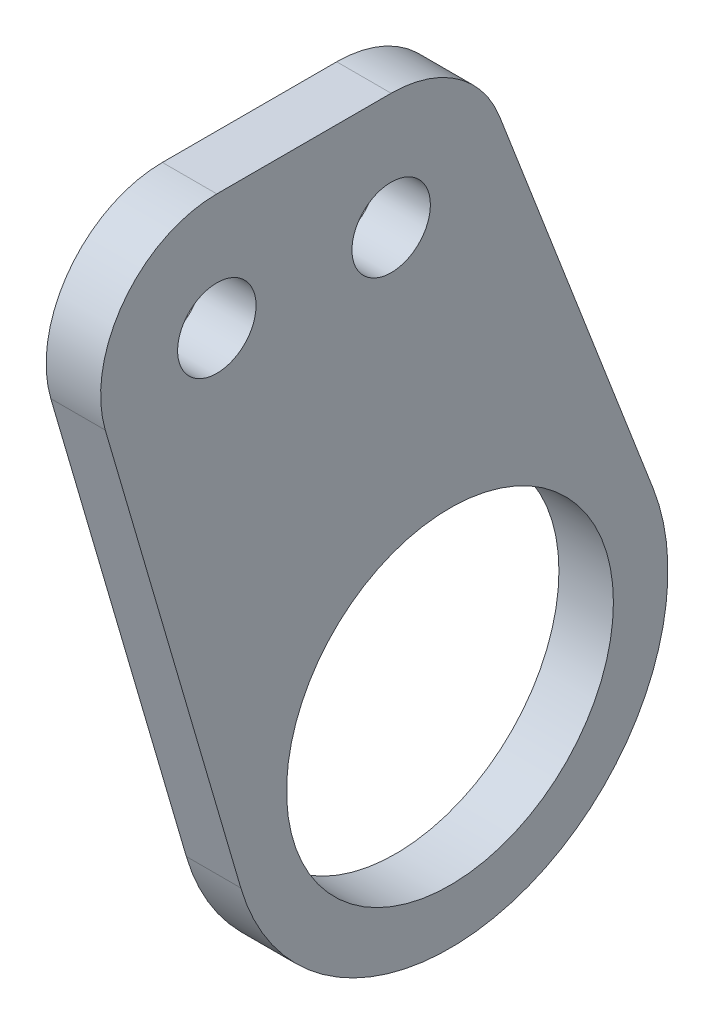
ISO-10303-21;
HEADER;
FILE_DESCRIPTION(('STEP AP214'),'2;1');
FILE_NAME('part.step','',(''),(''),'','','');
FILE_SCHEMA(('AUTOMOTIVE_DESIGN { 1 0 10303 214 1 1 1 1 }'));
ENDSEC;
DATA;
#1=APPLICATION_CONTEXT('core data for automotive mechanical design processes');
#2=APPLICATION_PROTOCOL_DEFINITION('international standard','automotive_design',2000,#1);
#3=PRODUCT_CONTEXT('',#1,'mechanical');
#4=PRODUCT('Part','Part','',(#3));
#5=PRODUCT_RELATED_PRODUCT_CATEGORY('part','',(#4));
#6=PRODUCT_DEFINITION_FORMATION('','',#4);
#7=PRODUCT_DEFINITION_CONTEXT('part definition',#1,'design');
#8=PRODUCT_DEFINITION('design','',#6,#7);
#9=PRODUCT_DEFINITION_SHAPE('','',#8);
#10=(LENGTH_UNIT() NAMED_UNIT(*) SI_UNIT(.MILLI.,.METRE.));
#11=(NAMED_UNIT(*) PLANE_ANGLE_UNIT() SI_UNIT($,.RADIAN.));
#12=(NAMED_UNIT(*) SI_UNIT($,.STERADIAN.) SOLID_ANGLE_UNIT());
#13=UNCERTAINTY_MEASURE_WITH_UNIT(LENGTH_MEASURE(1.E-05),#10,'distance_accuracy_value','');
#14=(GEOMETRIC_REPRESENTATION_CONTEXT(3) GLOBAL_UNCERTAINTY_ASSIGNED_CONTEXT((#13)) GLOBAL_UNIT_ASSIGNED_CONTEXT((#10,
#11,#12)) REPRESENTATION_CONTEXT('',''));
#15=CARTESIAN_POINT('',(0.,0.,0.));
#16=DIRECTION('',(0.,0.,1.));
#17=DIRECTION('',(1.,0.,0.));
#18=AXIS2_PLACEMENT_3D('',#15,#16,#17);
#19=CARTESIAN_POINT('',(4.7625,38.1,20.3835));
#20=DIRECTION('',(1.,0.,0.));
#21=DIRECTION('',(0.,0.,-1.));
#22=AXIS2_PLACEMENT_3D('',#19,#20,#21);
#23=PLANE('',#22);
#24=CARTESIAN_POINT('',(4.7625,38.1,20.3835));
#25=DIRECTION('',(1.,0.,0.));
#26=DIRECTION('',(0.,0.,-1.));
#27=AXIS2_PLACEMENT_3D('',#24,#25,#26);
#28=CIRCLE('',#27,3.429);
#29=CARTESIAN_POINT('',(4.7625,38.1,16.9545));
#30=VERTEX_POINT('',#29);
#31=EDGE_CURVE('E211',#30,#30,#28,.T.);
#32=ORIENTED_EDGE('',*,*,#31,.F.);
#33=EDGE_LOOP('',(#32));
#34=FACE_BOUND('',#33,.T.);
#35=CARTESIAN_POINT('',(4.7625,38.1,20.3835));
#36=DIRECTION('',(1.,0.,0.));
#37=DIRECTION('',(0.,0.,-1.));
#38=AXIS2_PLACEMENT_3D('',#35,#36,#37);
#39=CIRCLE('',#38,10.16);
#40=CARTESIAN_POINT('',(4.7625,48.26,20.3835));
#41=VERTEX_POINT('',#40);
#42=CARTESIAN_POINT('',(4.7625,35.2528565119008,30.1364161771326));
#43=VERTEX_POINT('',#42);
#44=EDGE_CURVE('E150',#41,#43,#39,.T.);
#45=ORIENTED_EDGE('',*,*,#44,.T.);
#46=DIRECTION('',(0.,-0.959932694599662,-0.280230658277485));
#47=VECTOR('',#46,1.);
#48=CARTESIAN_POINT('',(4.7625,35.2528565119008,30.1364161771326));
#49=LINE('',#48,#47);
#50=CARTESIAN_POINT('',(4.7625,-5.33839404018609,18.2867178321236));
#51=VERTEX_POINT('',#50);
#52=EDGE_CURVE('E98',#43,#51,#49,.T.);
#53=ORIENTED_EDGE('',*,*,#52,.T.);
#54=CARTESIAN_POINT('',(4.7625,0.,0.));
#55=DIRECTION('',(1.,0.,0.));
#56=DIRECTION('',(0.,0.,-1.));
#57=AXIS2_PLACEMENT_3D('',#54,#55,#56);
#58=CIRCLE('',#57,19.05);
#59=CARTESIAN_POINT('',(4.7625,6.84499672380729,-17.7777535096836));
#60=VERTEX_POINT('',#59);
#61=EDGE_CURVE('E111',#51,#60,#58,.T.);
#62=ORIENTED_EDGE('',*,*,#61,.T.);
#63=DIRECTION('',(0.,0.933215407332472,0.359317413323217));
#64=VECTOR('',#63,1.);
#65=CARTESIAN_POINT('',(4.7625,41.7506649193639,-4.33796853849792));
#66=LINE('',#65,#64);
#67=CARTESIAN_POINT('',(4.7625,41.7506649193639,-4.33796853849792));
#68=VERTEX_POINT('',#67);
#69=EDGE_CURVE('E105',#60,#68,#66,.T.);
#70=ORIENTED_EDGE('',*,*,#69,.T.);
#71=CARTESIAN_POINT('',(4.7625,38.1,5.1435));
#72=DIRECTION('',(1.,0.,0.));
#73=DIRECTION('',(0.,0.,-1.));
#74=AXIS2_PLACEMENT_3D('',#71,#72,#73);
#75=CIRCLE('',#74,10.16);
#76=CARTESIAN_POINT('',(4.7625,48.26,5.1435));
#77=VERTEX_POINT('',#76);
#78=EDGE_CURVE('E109',#68,#77,#75,.T.);
#79=ORIENTED_EDGE('',*,*,#78,.T.);
#80=DIRECTION('',(0.,0.,1.));
#81=VECTOR('',#80,1.);
#82=CARTESIAN_POINT('',(4.7625,48.26,20.3835));
#83=LINE('',#82,#81);
#84=EDGE_CURVE('E61',#77,#41,#83,.T.);
#85=ORIENTED_EDGE('',*,*,#84,.T.);
#86=EDGE_LOOP('',(#45,#53,#62,#70,#79,#85));
#87=FACE_BOUND('',#86,.T.);
#88=CARTESIAN_POINT('',(4.7625,0.,0.));
#89=DIRECTION('',(1.,0.,0.));
#90=DIRECTION('',(0.,0.,-1.));
#91=AXIS2_PLACEMENT_3D('',#88,#89,#90);
#92=CIRCLE('',#91,14.2875);
#93=CARTESIAN_POINT('',(4.7625,0.,-14.2875));
#94=VERTEX_POINT('',#93);
#95=EDGE_CURVE('E138',#94,#94,#92,.T.);
#96=ORIENTED_EDGE('',*,*,#95,.F.);
#97=EDGE_LOOP('',(#96));
#98=FACE_BOUND('',#97,.T.);
#99=CARTESIAN_POINT('',(4.7625,38.1,5.1435));
#100=DIRECTION('',(1.,0.,0.));
#101=DIRECTION('',(0.,0.,-1.));
#102=AXIS2_PLACEMENT_3D('',#99,#100,#101);
#103=CIRCLE('',#102,3.429);
#104=CARTESIAN_POINT('',(4.7625,38.1,1.7145));
#105=VERTEX_POINT('',#104);
#106=EDGE_CURVE('E200',#105,#105,#103,.T.);
#107=ORIENTED_EDGE('',*,*,#106,.F.);
#108=EDGE_LOOP('',(#107));
#109=FACE_BOUND('',#108,.T.);
#110=ADVANCED_FACE('F43',(#34,#87,#98,#109),#23,.T.);
#111=CARTESIAN_POINT('',(0.,38.1,20.3835));
#112=DIRECTION('',(1.,0.,0.));
#113=DIRECTION('',(0.,0.,-1.));
#114=AXIS2_PLACEMENT_3D('',#111,#112,#113);
#115=PLANE('',#114);
#116=CARTESIAN_POINT('',(0.,38.1,20.3835));
#117=DIRECTION('',(1.,0.,0.));
#118=DIRECTION('',(0.,0.,-1.));
#119=AXIS2_PLACEMENT_3D('',#116,#117,#118);
#120=CIRCLE('',#119,10.16);
#121=CARTESIAN_POINT('',(0.,48.26,20.3835));
#122=VERTEX_POINT('',#121);
#123=CARTESIAN_POINT('',(0.,35.2528565119008,30.1364161771326));
#124=VERTEX_POINT('',#123);
#125=EDGE_CURVE('E133',#122,#124,#120,.T.);
#126=ORIENTED_EDGE('',*,*,#125,.F.);
#127=DIRECTION('',(0.,0.,1.));
#128=VECTOR('',#127,1.);
#129=CARTESIAN_POINT('',(0.,48.26,20.3835));
#130=LINE('',#129,#128);
#131=CARTESIAN_POINT('',(0.,48.26,5.1435));
#132=VERTEX_POINT('',#131);
#133=EDGE_CURVE('E90',#132,#122,#130,.T.);
#134=ORIENTED_EDGE('',*,*,#133,.F.);
#135=CARTESIAN_POINT('',(0.,38.1,5.1435));
#136=DIRECTION('',(1.,0.,0.));
#137=DIRECTION('',(0.,0.,-1.));
#138=AXIS2_PLACEMENT_3D('',#135,#136,#137);
#139=CIRCLE('',#138,10.16);
#140=CARTESIAN_POINT('',(0.,41.7506649193639,-4.33796853849792));
#141=VERTEX_POINT('',#140);
#142=EDGE_CURVE('E84',#141,#132,#139,.T.);
#143=ORIENTED_EDGE('',*,*,#142,.F.);
#144=DIRECTION('',(0.,0.933215407332472,0.359317413323217));
#145=VECTOR('',#144,1.);
#146=CARTESIAN_POINT('',(0.,41.7506649193639,-4.33796853849792));
#147=LINE('',#146,#145);
#148=CARTESIAN_POINT('',(0.,6.84499672380729,-17.7777535096836));
#149=VERTEX_POINT('',#148);
#150=EDGE_CURVE('E120',#149,#141,#147,.T.);
#151=ORIENTED_EDGE('',*,*,#150,.F.);
#152=CARTESIAN_POINT('',(0.,0.,0.));
#153=DIRECTION('',(1.,0.,0.));
#154=DIRECTION('',(0.,0.,-1.));
#155=AXIS2_PLACEMENT_3D('',#152,#153,#154);
#156=CIRCLE('',#155,19.05);
#157=CARTESIAN_POINT('',(0.,-5.33839404018609,18.2867178321236));
#158=VERTEX_POINT('',#157);
#159=EDGE_CURVE('E141',#158,#149,#156,.T.);
#160=ORIENTED_EDGE('',*,*,#159,.F.);
#161=DIRECTION('',(0.,-0.959932694599662,-0.280230658277485));
#162=VECTOR('',#161,1.);
#163=CARTESIAN_POINT('',(0.,35.2528565119008,30.1364161771326));
#164=LINE('',#163,#162);
#165=EDGE_CURVE('E137',#124,#158,#164,.T.);
#166=ORIENTED_EDGE('',*,*,#165,.F.);
#167=EDGE_LOOP('',(#126,#134,#143,#151,#160,#166));
#168=FACE_BOUND('',#167,.T.);
#169=CARTESIAN_POINT('',(0.,0.,0.));
#170=DIRECTION('',(1.,0.,0.));
#171=DIRECTION('',(0.,0.,-1.));
#172=AXIS2_PLACEMENT_3D('',#169,#170,#171);
#173=CIRCLE('',#172,14.2875);
#174=CARTESIAN_POINT('',(0.,0.,-14.2875));
#175=VERTEX_POINT('',#174);
#176=EDGE_CURVE('E215',#175,#175,#173,.T.);
#177=ORIENTED_EDGE('',*,*,#176,.T.);
#178=EDGE_LOOP('',(#177));
#179=FACE_BOUND('',#178,.T.);
#180=CARTESIAN_POINT('',(0.,38.1,20.3835));
#181=DIRECTION('',(1.,0.,0.));
#182=DIRECTION('',(0.,0.,-1.));
#183=AXIS2_PLACEMENT_3D('',#180,#181,#182);
#184=CIRCLE('',#183,3.429);
#185=CARTESIAN_POINT('',(0.,38.1,16.9545));
#186=VERTEX_POINT('',#185);
#187=EDGE_CURVE('E208',#186,#186,#184,.T.);
#188=ORIENTED_EDGE('',*,*,#187,.T.);
#189=EDGE_LOOP('',(#188));
#190=FACE_BOUND('',#189,.T.);
#191=CARTESIAN_POINT('',(0.,38.1,5.1435));
#192=DIRECTION('',(1.,0.,0.));
#193=DIRECTION('',(0.,0.,-1.));
#194=AXIS2_PLACEMENT_3D('',#191,#192,#193);
#195=CIRCLE('',#194,3.429);
#196=CARTESIAN_POINT('',(0.,38.1,1.7145));
#197=VERTEX_POINT('',#196);
#198=EDGE_CURVE('E203',#197,#197,#195,.T.);
#199=ORIENTED_EDGE('',*,*,#198,.T.);
#200=EDGE_LOOP('',(#199));
#201=FACE_BOUND('',#200,.T.);
#202=ADVANCED_FACE('F163',(#168,#179,#190,#201),#115,.F.);
#203=CARTESIAN_POINT('',(4.7625,38.1,20.3835));
#204=DIRECTION('',(-1.,0.,0.));
#205=DIRECTION('',(0.,0.,1.));
#206=AXIS2_PLACEMENT_3D('',#203,#204,#205);
#207=CYLINDRICAL_SURFACE('',#206,10.16);
#208=ORIENTED_EDGE('',*,*,#125,.T.);
#209=DIRECTION('',(-1.,0.,0.));
#210=VECTOR('',#209,1.);
#211=CARTESIAN_POINT('',(4.7625,35.2528565119008,30.1364161771326));
#212=LINE('',#211,#210);
#213=EDGE_CURVE('E11',#43,#124,#212,.T.);
#214=ORIENTED_EDGE('',*,*,#213,.F.);
#215=ORIENTED_EDGE('',*,*,#44,.F.);
#216=DIRECTION('',(-1.,0.,0.));
#217=VECTOR('',#216,1.);
#218=CARTESIAN_POINT('',(4.7625,48.26,20.3835));
#219=LINE('',#218,#217);
#220=EDGE_CURVE('E129',#41,#122,#219,.T.);
#221=ORIENTED_EDGE('',*,*,#220,.T.);
#222=EDGE_LOOP('',(#208,#214,#215,#221));
#223=FACE_BOUND('',#222,.T.);
#224=ADVANCED_FACE('F45',(#223),#207,.T.);
#225=CARTESIAN_POINT('',(4.7625,35.2528565119008,30.1364161771326));
#226=DIRECTION('',(0.,0.280230658277485,-0.959932694599662));
#227=DIRECTION('',(0.,0.959932694599662,0.280230658277485));
#228=AXIS2_PLACEMENT_3D('',#225,#226,#227);
#229=PLANE('',#228);
#230=ORIENTED_EDGE('',*,*,#165,.T.);
#231=DIRECTION('',(-1.,0.,0.));
#232=VECTOR('',#231,1.);
#233=CARTESIAN_POINT('',(4.7625,-5.33839404018609,18.2867178321236));
#234=LINE('',#233,#232);
#235=EDGE_CURVE('E53',#51,#158,#234,.T.);
#236=ORIENTED_EDGE('',*,*,#235,.F.);
#237=ORIENTED_EDGE('',*,*,#52,.F.);
#238=ORIENTED_EDGE('',*,*,#213,.T.);
#239=EDGE_LOOP('',(#230,#236,#237,#238));
#240=FACE_BOUND('',#239,.T.);
#241=ADVANCED_FACE('F275',(#240),#229,.F.);
#242=CARTESIAN_POINT('',(4.7625,0.,0.));
#243=DIRECTION('',(-1.,0.,0.));
#244=DIRECTION('',(0.,0.,1.));
#245=AXIS2_PLACEMENT_3D('',#242,#243,#244);
#246=CYLINDRICAL_SURFACE('',#245,19.05);
#247=ORIENTED_EDGE('',*,*,#159,.T.);
#248=DIRECTION('',(-1.,0.,0.));
#249=VECTOR('',#248,1.);
#250=CARTESIAN_POINT('',(4.7625,6.84499672380729,-17.7777535096836));
#251=LINE('',#250,#249);
#252=EDGE_CURVE('E122',#60,#149,#251,.T.);
#253=ORIENTED_EDGE('',*,*,#252,.F.);
#254=ORIENTED_EDGE('',*,*,#61,.F.);
#255=ORIENTED_EDGE('',*,*,#235,.T.);
#256=EDGE_LOOP('',(#247,#253,#254,#255));
#257=FACE_BOUND('',#256,.T.);
#258=ADVANCED_FACE('F160',(#257),#246,.T.);
#259=CARTESIAN_POINT('',(4.7625,41.7506649193639,-4.33796853849792));
#260=DIRECTION('',(0.,-0.359317413323217,0.933215407332472));
#261=DIRECTION('',(0.,-0.933215407332472,-0.359317413323217));
#262=AXIS2_PLACEMENT_3D('',#259,#260,#261);
#263=PLANE('',#262);
#264=ORIENTED_EDGE('',*,*,#150,.T.);
#265=DIRECTION('',(-1.,0.,0.));
#266=VECTOR('',#265,1.);
#267=CARTESIAN_POINT('',(4.7625,41.7506649193639,-4.33796853849792));
#268=LINE('',#267,#266);
#269=EDGE_CURVE('E117',#68,#141,#268,.T.);
#270=ORIENTED_EDGE('',*,*,#269,.F.);
#271=ORIENTED_EDGE('',*,*,#69,.F.);
#272=ORIENTED_EDGE('',*,*,#252,.T.);
#273=EDGE_LOOP('',(#264,#270,#271,#272));
#274=FACE_BOUND('',#273,.T.);
#275=ADVANCED_FACE('F118',(#274),#263,.F.);
#276=CARTESIAN_POINT('',(4.7625,38.1,5.1435));
#277=DIRECTION('',(-1.,0.,0.));
#278=DIRECTION('',(0.,0.,1.));
#279=AXIS2_PLACEMENT_3D('',#276,#277,#278);
#280=CYLINDRICAL_SURFACE('',#279,10.16);
#281=ORIENTED_EDGE('',*,*,#142,.T.);
#282=DIRECTION('',(-1.,0.,0.));
#283=VECTOR('',#282,1.);
#284=CARTESIAN_POINT('',(4.7625,48.26,5.1435));
#285=LINE('',#284,#283);
#286=EDGE_CURVE('E123',#77,#132,#285,.T.);
#287=ORIENTED_EDGE('',*,*,#286,.F.);
#288=ORIENTED_EDGE('',*,*,#78,.F.);
#289=ORIENTED_EDGE('',*,*,#269,.T.);
#290=EDGE_LOOP('',(#281,#287,#288,#289));
#291=FACE_BOUND('',#290,.T.);
#292=ADVANCED_FACE('F125',(#291),#280,.T.);
#293=CARTESIAN_POINT('',(4.7625,48.26,20.3835));
#294=DIRECTION('',(0.,-1.,0.));
#295=DIRECTION('',(0.,0.,-1.));
#296=AXIS2_PLACEMENT_3D('',#293,#294,#295);
#297=PLANE('',#296);
#298=ORIENTED_EDGE('',*,*,#133,.T.);
#299=ORIENTED_EDGE('',*,*,#220,.F.);
#300=ORIENTED_EDGE('',*,*,#84,.F.);
#301=ORIENTED_EDGE('',*,*,#286,.T.);
#302=EDGE_LOOP('',(#298,#299,#300,#301));
#303=FACE_BOUND('',#302,.T.);
#304=ADVANCED_FACE('F168',(#303),#297,.F.);
#305=CARTESIAN_POINT('',(4.7625,0.,0.));
#306=DIRECTION('',(-1.,0.,0.));
#307=DIRECTION('',(0.,0.,1.));
#308=AXIS2_PLACEMENT_3D('',#305,#306,#307);
#309=CYLINDRICAL_SURFACE('',#308,14.2875);
#310=ORIENTED_EDGE('',*,*,#95,.T.);
#311=EDGE_LOOP('',(#310));
#312=FACE_BOUND('',#311,.T.);
#313=ORIENTED_EDGE('',*,*,#176,.F.);
#314=EDGE_LOOP('',(#313));
#315=FACE_BOUND('',#314,.T.);
#316=ADVANCED_FACE('F170',(#312,#315),#309,.F.);
#317=CARTESIAN_POINT('',(4.7625,38.1,20.3835));
#318=DIRECTION('',(-1.,0.,0.));
#319=DIRECTION('',(0.,0.,1.));
#320=AXIS2_PLACEMENT_3D('',#317,#318,#319);
#321=CYLINDRICAL_SURFACE('',#320,3.429);
#322=ORIENTED_EDGE('',*,*,#31,.T.);
#323=EDGE_LOOP('',(#322));
#324=FACE_BOUND('',#323,.T.);
#325=ORIENTED_EDGE('',*,*,#187,.F.);
#326=EDGE_LOOP('',(#325));
#327=FACE_BOUND('',#326,.T.);
#328=ADVANCED_FACE('F176',(#324,#327),#321,.F.);
#329=CARTESIAN_POINT('',(4.7625,38.1,5.1435));
#330=DIRECTION('',(-1.,0.,0.));
#331=DIRECTION('',(0.,0.,1.));
#332=AXIS2_PLACEMENT_3D('',#329,#330,#331);
#333=CYLINDRICAL_SURFACE('',#332,3.429);
#334=ORIENTED_EDGE('',*,*,#106,.T.);
#335=EDGE_LOOP('',(#334));
#336=FACE_BOUND('',#335,.T.);
#337=ORIENTED_EDGE('',*,*,#198,.F.);
#338=EDGE_LOOP('',(#337));
#339=FACE_BOUND('',#338,.T.);
#340=ADVANCED_FACE('F191',(#336,#339),#333,.F.);
#341=CLOSED_SHELL('',(#110,#202,#224,#241,#258,#275,#292,#304,#316,#328,#340));
#342=MANIFOLD_SOLID_BREP('B2',#341);
#343=ADVANCED_BREP_SHAPE_REPRESENTATION('',(#18,#342),#14);
#344=SHAPE_DEFINITION_REPRESENTATION(#9,#343);
ENDSEC;
END-ISO-10303-21;
